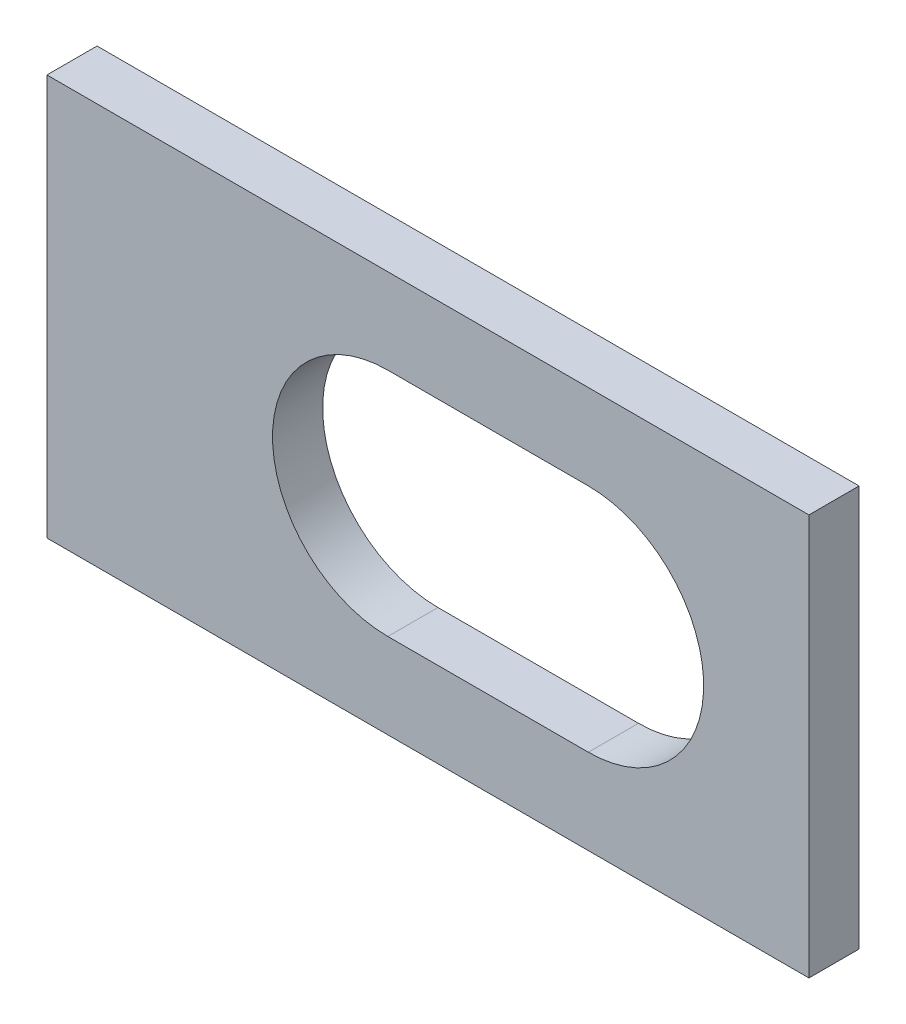
ISO-10303-21;
HEADER;
FILE_DESCRIPTION(('STEP AP214'),'2;1');
FILE_NAME('part.step','',(''),(''),'','','');
FILE_SCHEMA(('AUTOMOTIVE_DESIGN { 1 0 10303 214 1 1 1 1 }'));
ENDSEC;
DATA;
#1=APPLICATION_CONTEXT('core data for automotive mechanical design processes');
#2=APPLICATION_PROTOCOL_DEFINITION('international standard','automotive_design',2000,#1);
#3=PRODUCT_CONTEXT('',#1,'mechanical');
#4=PRODUCT('Part','Part','',(#3));
#5=PRODUCT_RELATED_PRODUCT_CATEGORY('part','',(#4));
#6=PRODUCT_DEFINITION_FORMATION('','',#4);
#7=PRODUCT_DEFINITION_CONTEXT('part definition',#1,'design');
#8=PRODUCT_DEFINITION('design','',#6,#7);
#9=PRODUCT_DEFINITION_SHAPE('','',#8);
#10=(LENGTH_UNIT() NAMED_UNIT(*) SI_UNIT(.MILLI.,.METRE.));
#11=(NAMED_UNIT(*) PLANE_ANGLE_UNIT() SI_UNIT($,.RADIAN.));
#12=(NAMED_UNIT(*) SI_UNIT($,.STERADIAN.) SOLID_ANGLE_UNIT());
#13=UNCERTAINTY_MEASURE_WITH_UNIT(LENGTH_MEASURE(1.E-05),#10,'distance_accuracy_value','');
#14=(GEOMETRIC_REPRESENTATION_CONTEXT(3) GLOBAL_UNCERTAINTY_ASSIGNED_CONTEXT((#13)) GLOBAL_UNIT_ASSIGNED_CONTEXT((#10,
#11,#12)) REPRESENTATION_CONTEXT('',''));
#15=CARTESIAN_POINT('',(0.,0.,0.));
#16=DIRECTION('',(0.,0.,1.));
#17=DIRECTION('',(1.,0.,0.));
#18=AXIS2_PLACEMENT_3D('',#15,#16,#17);
#19=CARTESIAN_POINT('',(9.1,0.999999999999995,1.00000000000002));
#20=DIRECTION('',(0.,0.,-1.));
#21=DIRECTION('',(1.,0.,0.));
#22=AXIS2_PLACEMENT_3D('',#19,#20,#21);
#23=PLANE('',#22);
#24=DIRECTION('',(0.,1.,0.));
#25=VECTOR('',#24,1.);
#26=CARTESIAN_POINT('',(9.1,-1.00000000000001,1.00000000000002));
#27=LINE('',#26,#25);
#28=CARTESIAN_POINT('',(9.1,-1.00000000000001,1.00000000000002));
#29=VERTEX_POINT('',#28);
#30=CARTESIAN_POINT('',(9.1,0.999999999999995,1.00000000000002));
#31=VERTEX_POINT('',#30);
#32=EDGE_CURVE('E122',#29,#31,#27,.T.);
#33=ORIENTED_EDGE('',*,*,#32,.T.);
#34=DIRECTION('',(-1.,0.,0.));
#35=VECTOR('',#34,1.);
#36=CARTESIAN_POINT('',(9.1,0.999999999999995,1.00000000000002));
#37=LINE('',#36,#35);
#38=CARTESIAN_POINT('',(5.3,0.999999999999998,1.00000000000001));
#39=VERTEX_POINT('',#38);
#40=EDGE_CURVE('E125',#31,#39,#37,.T.);
#41=ORIENTED_EDGE('',*,*,#40,.T.);
#42=DIRECTION('',(0.,-1.,0.));
#43=VECTOR('',#42,1.);
#44=CARTESIAN_POINT('',(5.3,0.999999999999998,1.00000000000001));
#45=LINE('',#44,#43);
#46=CARTESIAN_POINT('',(5.3,-1.,1.00000000000001));
#47=VERTEX_POINT('',#46);
#48=EDGE_CURVE('E128',#39,#47,#45,.T.);
#49=ORIENTED_EDGE('',*,*,#48,.T.);
#50=DIRECTION('',(1.,0.,0.));
#51=VECTOR('',#50,1.);
#52=CARTESIAN_POINT('',(5.3,-1.,1.00000000000001));
#53=LINE('',#52,#51);
#54=EDGE_CURVE('E114',#47,#29,#53,.T.);
#55=ORIENTED_EDGE('',*,*,#54,.T.);
#56=EDGE_LOOP('',(#33,#41,#49,#55));
#57=FACE_BOUND('',#56,.T.);
#58=DIRECTION('',(1.,0.,0.));
#59=VECTOR('',#58,1.);
#60=CARTESIAN_POINT('',(8.,0.574999999999989,1.00000000000002));
#61=LINE('',#60,#59);
#62=CARTESIAN_POINT('',(7.,0.57499999999999,1.00000000000002));
#63=VERTEX_POINT('',#62);
#64=CARTESIAN_POINT('',(8.,0.574999999999989,1.00000000000002));
#65=VERTEX_POINT('',#64);
#66=EDGE_CURVE('E98',#63,#65,#61,.T.);
#67=ORIENTED_EDGE('',*,*,#66,.T.);
#68=CARTESIAN_POINT('',(8.,0.,1.00000000000001));
#69=DIRECTION('',(0.,0.,1.));
#70=DIRECTION('',(1.,0.,0.));
#71=AXIS2_PLACEMENT_3D('',#68,#69,#70);
#72=CIRCLE('',#71,0.575);
#73=CARTESIAN_POINT('',(8.,-0.575000000000011,1.00000000000001));
#74=VERTEX_POINT('',#73);
#75=EDGE_CURVE('E83',#65,#74,#72,.F.);
#76=ORIENTED_EDGE('',*,*,#75,.T.);
#77=DIRECTION('',(-1.,0.,0.));
#78=VECTOR('',#77,1.);
#79=CARTESIAN_POINT('',(7.,-0.57500000000001,1.00000000000001));
#80=LINE('',#79,#78);
#81=CARTESIAN_POINT('',(7.,-0.57500000000001,1.00000000000001));
#82=VERTEX_POINT('',#81);
#83=EDGE_CURVE('E91',#74,#82,#80,.T.);
#84=ORIENTED_EDGE('',*,*,#83,.T.);
#85=CARTESIAN_POINT('',(7.,0.,1.00000000000001));
#86=DIRECTION('',(0.,0.,1.));
#87=DIRECTION('',(1.,0.,0.));
#88=AXIS2_PLACEMENT_3D('',#85,#86,#87);
#89=CIRCLE('',#88,0.575);
#90=EDGE_CURVE('E95',#82,#63,#89,.F.);
#91=ORIENTED_EDGE('',*,*,#90,.T.);
#92=EDGE_LOOP('',(#67,#76,#84,#91));
#93=FACE_BOUND('',#92,.T.);
#94=ADVANCED_FACE('F16',(#57,#93),#23,.F.);
#95=CARTESIAN_POINT('',(9.1,-1.00000000000001,0.750000000000015));
#96=DIRECTION('',(-1.,0.,0.));
#97=DIRECTION('',(0.,0.,-1.));
#98=AXIS2_PLACEMENT_3D('',#95,#96,#97);
#99=PLANE('',#98);
#100=ORIENTED_EDGE('',*,*,#32,.F.);
#101=DIRECTION('',(0.,0.,1.));
#102=VECTOR('',#101,1.);
#103=CARTESIAN_POINT('',(9.1,-1.00000000000001,0.750000000000015));
#104=LINE('',#103,#102);
#105=CARTESIAN_POINT('',(9.1,-1.00000000000001,0.750000000000015));
#106=VERTEX_POINT('',#105);
#107=EDGE_CURVE('E20',#106,#29,#104,.T.);
#108=ORIENTED_EDGE('',*,*,#107,.F.);
#109=DIRECTION('',(0.,1.,0.));
#110=VECTOR('',#109,1.);
#111=CARTESIAN_POINT('',(9.1,-1.00000000000001,0.750000000000015));
#112=LINE('',#111,#110);
#113=CARTESIAN_POINT('',(9.1,0.999999999999995,0.750000000000018));
#114=VERTEX_POINT('',#113);
#115=EDGE_CURVE('E110',#106,#114,#112,.T.);
#116=ORIENTED_EDGE('',*,*,#115,.T.);
#117=DIRECTION('',(0.,0.,1.));
#118=VECTOR('',#117,1.);
#119=CARTESIAN_POINT('',(9.1,0.999999999999995,0.750000000000018));
#120=LINE('',#119,#118);
#121=EDGE_CURVE('E10',#114,#31,#120,.T.);
#122=ORIENTED_EDGE('',*,*,#121,.T.);
#123=EDGE_LOOP('',(#100,#108,#116,#122));
#124=FACE_BOUND('',#123,.T.);
#125=ADVANCED_FACE('F18',(#124),#99,.F.);
#126=CARTESIAN_POINT('',(9.1,0.999999999999995,0.750000000000018));
#127=DIRECTION('',(0.,-1.,0.));
#128=DIRECTION('',(-1.,0.,0.));
#129=AXIS2_PLACEMENT_3D('',#126,#127,#128);
#130=PLANE('',#129);
#131=ORIENTED_EDGE('',*,*,#40,.F.);
#132=ORIENTED_EDGE('',*,*,#121,.F.);
#133=DIRECTION('',(-1.,0.,0.));
#134=VECTOR('',#133,1.);
#135=CARTESIAN_POINT('',(9.1,0.999999999999995,0.750000000000018));
#136=LINE('',#135,#134);
#137=CARTESIAN_POINT('',(5.3,0.999999999999998,0.750000000000012));
#138=VERTEX_POINT('',#137);
#139=EDGE_CURVE('E113',#114,#138,#136,.T.);
#140=ORIENTED_EDGE('',*,*,#139,.T.);
#141=DIRECTION('',(0.,0.,1.));
#142=VECTOR('',#141,1.);
#143=CARTESIAN_POINT('',(5.3,0.999999999999998,0.750000000000012));
#144=LINE('',#143,#142);
#145=EDGE_CURVE('E25',#138,#39,#144,.T.);
#146=ORIENTED_EDGE('',*,*,#145,.T.);
#147=EDGE_LOOP('',(#131,#132,#140,#146));
#148=FACE_BOUND('',#147,.T.);
#149=ADVANCED_FACE('F139',(#148),#130,.F.);
#150=CARTESIAN_POINT('',(5.3,0.999999999999998,0.750000000000012));
#151=DIRECTION('',(1.,0.,0.));
#152=DIRECTION('',(0.,0.,1.));
#153=AXIS2_PLACEMENT_3D('',#150,#151,#152);
#154=PLANE('',#153);
#155=ORIENTED_EDGE('',*,*,#48,.F.);
#156=ORIENTED_EDGE('',*,*,#145,.F.);
#157=DIRECTION('',(0.,-1.,0.));
#158=VECTOR('',#157,1.);
#159=CARTESIAN_POINT('',(5.3,0.999999999999998,0.750000000000012));
#160=LINE('',#159,#158);
#161=CARTESIAN_POINT('',(5.3,-1.,0.75000000000001));
#162=VERTEX_POINT('',#161);
#163=EDGE_CURVE('E117',#138,#162,#160,.T.);
#164=ORIENTED_EDGE('',*,*,#163,.T.);
#165=DIRECTION('',(0.,0.,1.));
#166=VECTOR('',#165,1.);
#167=CARTESIAN_POINT('',(5.3,-1.,0.75000000000001));
#168=LINE('',#167,#166);
#169=EDGE_CURVE('E133',#162,#47,#168,.T.);
#170=ORIENTED_EDGE('',*,*,#169,.T.);
#171=EDGE_LOOP('',(#155,#156,#164,#170));
#172=FACE_BOUND('',#171,.T.);
#173=ADVANCED_FACE('F142',(#172),#154,.F.);
#174=CARTESIAN_POINT('',(5.3,-1.,0.75000000000001));
#175=DIRECTION('',(0.,1.,0.));
#176=DIRECTION('',(1.,0.,0.));
#177=AXIS2_PLACEMENT_3D('',#174,#175,#176);
#178=PLANE('',#177);
#179=ORIENTED_EDGE('',*,*,#54,.F.);
#180=ORIENTED_EDGE('',*,*,#169,.F.);
#181=DIRECTION('',(1.,0.,0.));
#182=VECTOR('',#181,1.);
#183=CARTESIAN_POINT('',(5.3,-1.,0.75000000000001));
#184=LINE('',#183,#182);
#185=EDGE_CURVE('E120',#162,#106,#184,.T.);
#186=ORIENTED_EDGE('',*,*,#185,.T.);
#187=ORIENTED_EDGE('',*,*,#107,.T.);
#188=EDGE_LOOP('',(#179,#180,#186,#187));
#189=FACE_BOUND('',#188,.T.);
#190=ADVANCED_FACE('F153',(#189),#178,.F.);
#191=CARTESIAN_POINT('',(9.1,0.999999999999995,0.750000000000018));
#192=DIRECTION('',(0.,0.,-1.));
#193=DIRECTION('',(1.,0.,0.));
#194=AXIS2_PLACEMENT_3D('',#191,#192,#193);
#195=PLANE('',#194);
#196=CARTESIAN_POINT('',(8.,0.,0.749999999999987));
#197=DIRECTION('',(0.,0.,1.));
#198=DIRECTION('',(1.,0.,0.));
#199=AXIS2_PLACEMENT_3D('',#196,#197,#198);
#200=CIRCLE('',#199,0.575);
#201=CARTESIAN_POINT('',(8.,-0.575000000000011,0.749999999999987));
#202=VERTEX_POINT('',#201);
#203=CARTESIAN_POINT('',(8.,0.574999999999989,0.749999999999987));
#204=VERTEX_POINT('',#203);
#205=EDGE_CURVE('E86',#202,#204,#200,.T.);
#206=ORIENTED_EDGE('',*,*,#205,.T.);
#207=DIRECTION('',(-1.,0.,0.));
#208=VECTOR('',#207,1.);
#209=CARTESIAN_POINT('',(8.,0.574999999999989,0.75000000000003));
#210=LINE('',#209,#208);
#211=CARTESIAN_POINT('',(7.,0.57499999999999,0.750000000000028));
#212=VERTEX_POINT('',#211);
#213=EDGE_CURVE('E184',#204,#212,#210,.T.);
#214=ORIENTED_EDGE('',*,*,#213,.T.);
#215=CARTESIAN_POINT('',(7.,0.,0.749999999999987));
#216=DIRECTION('',(0.,0.,1.));
#217=DIRECTION('',(1.,0.,0.));
#218=AXIS2_PLACEMENT_3D('',#215,#216,#217);
#219=CIRCLE('',#218,0.575);
#220=CARTESIAN_POINT('',(7.,-0.57500000000001,0.750000000000013));
#221=VERTEX_POINT('',#220);
#222=EDGE_CURVE('E186',#212,#221,#219,.T.);
#223=ORIENTED_EDGE('',*,*,#222,.T.);
#224=DIRECTION('',(1.,0.,0.));
#225=VECTOR('',#224,1.);
#226=CARTESIAN_POINT('',(7.,-0.57500000000001,0.750000000000022));
#227=LINE('',#226,#225);
#228=EDGE_CURVE('E88',#221,#202,#227,.T.);
#229=ORIENTED_EDGE('',*,*,#228,.T.);
#230=EDGE_LOOP('',(#206,#214,#223,#229));
#231=FACE_BOUND('',#230,.T.);
#232=ORIENTED_EDGE('',*,*,#115,.F.);
#233=ORIENTED_EDGE('',*,*,#185,.F.);
#234=ORIENTED_EDGE('',*,*,#163,.F.);
#235=ORIENTED_EDGE('',*,*,#139,.F.);
#236=EDGE_LOOP('',(#232,#233,#234,#235));
#237=FACE_BOUND('',#236,.T.);
#238=ADVANCED_FACE('F151',(#231,#237),#195,.T.);
#239=CARTESIAN_POINT('',(8.,0.,3.2249999999998));
#240=DIRECTION('',(0.,0.,-1.));
#241=DIRECTION('',(1.,0.,0.));
#242=AXIS2_PLACEMENT_3D('',#239,#240,#241);
#243=CYLINDRICAL_SURFACE('',#242,0.575);
#244=ORIENTED_EDGE('',*,*,#75,.F.);
#245=DIRECTION('',(0.,0.,-1.));
#246=VECTOR('',#245,1.);
#247=CARTESIAN_POINT('',(8.,0.574999999999989,3.2249999999998));
#248=LINE('',#247,#246);
#249=EDGE_CURVE('E99',#65,#204,#248,.T.);
#250=ORIENTED_EDGE('',*,*,#249,.T.);
#251=ORIENTED_EDGE('',*,*,#205,.F.);
#252=DIRECTION('',(0.,0.,-1.));
#253=VECTOR('',#252,1.);
#254=CARTESIAN_POINT('',(8.,-0.575000000000011,3.2249999999998));
#255=LINE('',#254,#253);
#256=EDGE_CURVE('E80',#74,#202,#255,.T.);
#257=ORIENTED_EDGE('',*,*,#256,.F.);
#258=EDGE_LOOP('',(#244,#250,#251,#257));
#259=FACE_BOUND('',#258,.T.);
#260=ADVANCED_FACE('F81',(#259),#243,.F.);
#261=CARTESIAN_POINT('',(8.,0.574999999999989,3.22499999999985));
#262=DIRECTION('',(0.,1.,0.));
#263=DIRECTION('',(1.,0.,0.));
#264=AXIS2_PLACEMENT_3D('',#261,#262,#263);
#265=PLANE('',#264);
#266=ORIENTED_EDGE('',*,*,#66,.F.);
#267=DIRECTION('',(0.,0.,-1.));
#268=VECTOR('',#267,1.);
#269=CARTESIAN_POINT('',(7.,0.57499999999999,3.22499999999984));
#270=LINE('',#269,#268);
#271=EDGE_CURVE('E101',#63,#212,#270,.T.);
#272=ORIENTED_EDGE('',*,*,#271,.T.);
#273=ORIENTED_EDGE('',*,*,#213,.F.);
#274=ORIENTED_EDGE('',*,*,#249,.F.);
#275=EDGE_LOOP('',(#266,#272,#273,#274));
#276=FACE_BOUND('',#275,.T.);
#277=ADVANCED_FACE('F175',(#276),#265,.F.);
#278=CARTESIAN_POINT('',(7.,0.,3.2249999999998));
#279=DIRECTION('',(0.,0.,-1.));
#280=DIRECTION('',(1.,0.,0.));
#281=AXIS2_PLACEMENT_3D('',#278,#279,#280);
#282=CYLINDRICAL_SURFACE('',#281,0.575);
#283=ORIENTED_EDGE('',*,*,#90,.F.);
#284=DIRECTION('',(0.,0.,-1.));
#285=VECTOR('',#284,1.);
#286=CARTESIAN_POINT('',(7.,-0.57500000000001,3.2249999999998));
#287=LINE('',#286,#285);
#288=EDGE_CURVE('E32',#82,#221,#287,.T.);
#289=ORIENTED_EDGE('',*,*,#288,.T.);
#290=ORIENTED_EDGE('',*,*,#222,.F.);
#291=ORIENTED_EDGE('',*,*,#271,.F.);
#292=EDGE_LOOP('',(#283,#289,#290,#291));
#293=FACE_BOUND('',#292,.T.);
#294=ADVANCED_FACE('F172',(#293),#282,.F.);
#295=CARTESIAN_POINT('',(7.,-0.57500000000001,3.22499999999984));
#296=DIRECTION('',(0.,-1.,0.));
#297=DIRECTION('',(-1.,0.,0.));
#298=AXIS2_PLACEMENT_3D('',#295,#296,#297);
#299=PLANE('',#298);
#300=ORIENTED_EDGE('',*,*,#83,.F.);
#301=ORIENTED_EDGE('',*,*,#256,.T.);
#302=ORIENTED_EDGE('',*,*,#228,.F.);
#303=ORIENTED_EDGE('',*,*,#288,.F.);
#304=EDGE_LOOP('',(#300,#301,#302,#303));
#305=FACE_BOUND('',#304,.T.);
#306=ADVANCED_FACE('F92',(#305),#299,.F.);
#307=CLOSED_SHELL('',(#94,#125,#149,#173,#190,#238,#260,#277,#294,#306));
#308=MANIFOLD_SOLID_BREP('B1',#307);
#309=ADVANCED_BREP_SHAPE_REPRESENTATION('',(#18,#308),#14);
#310=SHAPE_DEFINITION_REPRESENTATION(#9,#309);
ENDSEC;
END-ISO-10303-21;
